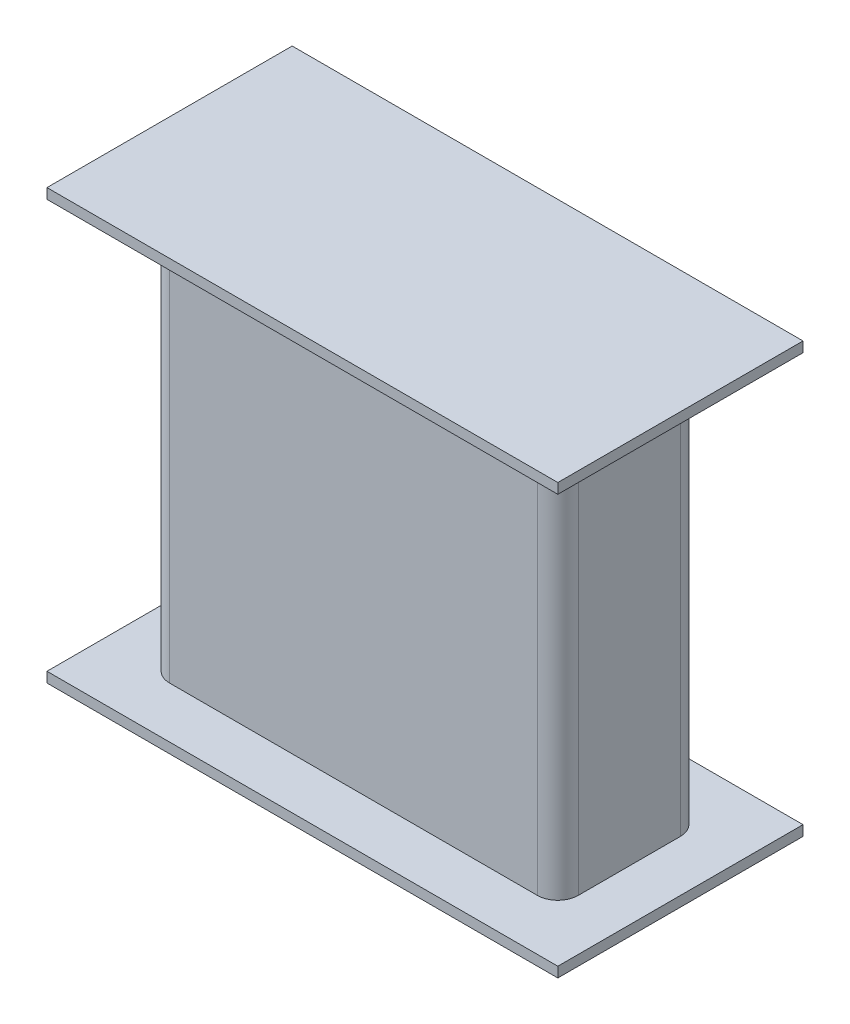
ISO-10303-21;
HEADER;
FILE_DESCRIPTION(('STEP AP214'),'2;1');
FILE_NAME('part.step','',(''),(''),'','','');
FILE_SCHEMA(('AUTOMOTIVE_DESIGN { 1 0 10303 214 1 1 1 1 }'));
ENDSEC;
DATA;
#1=APPLICATION_CONTEXT('core data for automotive mechanical design processes');
#2=APPLICATION_PROTOCOL_DEFINITION('international standard','automotive_design',2000,#1);
#3=PRODUCT_CONTEXT('',#1,'mechanical');
#4=PRODUCT('Part','Part','',(#3));
#5=PRODUCT_RELATED_PRODUCT_CATEGORY('part','',(#4));
#6=PRODUCT_DEFINITION_FORMATION('','',#4);
#7=PRODUCT_DEFINITION_CONTEXT('part definition',#1,'design');
#8=PRODUCT_DEFINITION('design','',#6,#7);
#9=PRODUCT_DEFINITION_SHAPE('','',#8);
#10=(LENGTH_UNIT() NAMED_UNIT(*) SI_UNIT(.MILLI.,.METRE.));
#11=(NAMED_UNIT(*) PLANE_ANGLE_UNIT() SI_UNIT($,.RADIAN.));
#12=(NAMED_UNIT(*) SI_UNIT($,.STERADIAN.) SOLID_ANGLE_UNIT());
#13=UNCERTAINTY_MEASURE_WITH_UNIT(LENGTH_MEASURE(1.E-05),#10,'distance_accuracy_value','');
#14=(GEOMETRIC_REPRESENTATION_CONTEXT(3) GLOBAL_UNCERTAINTY_ASSIGNED_CONTEXT((#13)) GLOBAL_UNIT_ASSIGNED_CONTEXT((#10,
#11,#12)) REPRESENTATION_CONTEXT('',''));
#15=CARTESIAN_POINT('',(0.,0.,0.));
#16=DIRECTION('',(0.,0.,1.));
#17=DIRECTION('',(1.,0.,0.));
#18=AXIS2_PLACEMENT_3D('',#15,#16,#17);
#19=CARTESIAN_POINT('',(0.,40.,-14.));
#20=DIRECTION('',(1.,0.,0.));
#21=DIRECTION('',(0.,0.,-1.));
#22=AXIS2_PLACEMENT_3D('',#19,#20,#21);
#23=PLANE('',#22);
#24=DIRECTION('',(0.,0.,1.));
#25=VECTOR('',#24,1.);
#26=CARTESIAN_POINT('',(0.,40.,-14.));
#27=LINE('',#26,#25);
#28=CARTESIAN_POINT('',(0.,40.,-12.));
#29=VERTEX_POINT('',#28);
#30=CARTESIAN_POINT('',(0.,40.,-2.00000000000001));
#31=VERTEX_POINT('',#30);
#32=EDGE_CURVE('E315',#29,#31,#27,.T.);
#33=ORIENTED_EDGE('',*,*,#32,.F.);
#34=DIRECTION('',(0.,-1.,0.));
#35=VECTOR('',#34,1.);
#36=CARTESIAN_POINT('',(0.,40.,-12.));
#37=LINE('',#36,#35);
#38=CARTESIAN_POINT('',(0.,0.,-12.));
#39=VERTEX_POINT('',#38);
#40=EDGE_CURVE('E289',#29,#39,#37,.T.);
#41=ORIENTED_EDGE('',*,*,#40,.T.);
#42=DIRECTION('',(0.,0.,1.));
#43=VECTOR('',#42,1.);
#44=CARTESIAN_POINT('',(0.,0.,-14.));
#45=LINE('',#44,#43);
#46=CARTESIAN_POINT('',(0.,0.,-2.00000000000001));
#47=VERTEX_POINT('',#46);
#48=EDGE_CURVE('E314',#39,#47,#45,.T.);
#49=ORIENTED_EDGE('',*,*,#48,.T.);
#50=DIRECTION('',(0.,-1.,0.));
#51=VECTOR('',#50,1.);
#52=CARTESIAN_POINT('',(0.,40.,-2.00000000000001));
#53=LINE('',#52,#51);
#54=EDGE_CURVE('E292',#31,#47,#53,.T.);
#55=ORIENTED_EDGE('',*,*,#54,.F.);
#56=EDGE_LOOP('',(#33,#41,#49,#55));
#57=FACE_BOUND('',#56,.T.);
#58=ADVANCED_FACE('F33',(#57),#23,.F.);
#59=CARTESIAN_POINT('',(0.,40.,0.));
#60=DIRECTION('',(0.,0.,-1.));
#61=DIRECTION('',(-1.,0.,0.));
#62=AXIS2_PLACEMENT_3D('',#59,#60,#61);
#63=PLANE('',#62);
#64=DIRECTION('',(1.,0.,0.));
#65=VECTOR('',#64,1.);
#66=CARTESIAN_POINT('',(0.,40.,0.));
#67=LINE('',#66,#65);
#68=CARTESIAN_POINT('',(2.,40.,0.));
#69=VERTEX_POINT('',#68);
#70=CARTESIAN_POINT('',(38.,40.,0.));
#71=VERTEX_POINT('',#70);
#72=EDGE_CURVE('E317',#69,#71,#67,.T.);
#73=ORIENTED_EDGE('',*,*,#72,.F.);
#74=DIRECTION('',(0.,-1.,0.));
#75=VECTOR('',#74,1.);
#76=CARTESIAN_POINT('',(2.00000000000001,40.,0.));
#77=LINE('',#76,#75);
#78=CARTESIAN_POINT('',(2.,0.,0.));
#79=VERTEX_POINT('',#78);
#80=EDGE_CURVE('E294',#69,#79,#77,.T.);
#81=ORIENTED_EDGE('',*,*,#80,.T.);
#82=DIRECTION('',(1.,0.,0.));
#83=VECTOR('',#82,1.);
#84=CARTESIAN_POINT('',(0.,0.,0.));
#85=LINE('',#84,#83);
#86=CARTESIAN_POINT('',(38.,0.,0.));
#87=VERTEX_POINT('',#86);
#88=EDGE_CURVE('E322',#79,#87,#85,.T.);
#89=ORIENTED_EDGE('',*,*,#88,.T.);
#90=DIRECTION('',(0.,-1.,0.));
#91=VECTOR('',#90,1.);
#92=CARTESIAN_POINT('',(38.,40.,0.));
#93=LINE('',#92,#91);
#94=EDGE_CURVE('E296',#71,#87,#93,.T.);
#95=ORIENTED_EDGE('',*,*,#94,.F.);
#96=EDGE_LOOP('',(#73,#81,#89,#95));
#97=FACE_BOUND('',#96,.T.);
#98=ADVANCED_FACE('F349',(#97),#63,.F.);
#99=CARTESIAN_POINT('',(40.,40.,-14.));
#100=DIRECTION('',(1.,0.,0.));
#101=DIRECTION('',(0.,0.,-1.));
#102=AXIS2_PLACEMENT_3D('',#99,#100,#101);
#103=PLANE('',#102);
#104=DIRECTION('',(0.,-1.,0.));
#105=VECTOR('',#104,1.);
#106=CARTESIAN_POINT('',(40.,40.,-12.));
#107=LINE('',#106,#105);
#108=CARTESIAN_POINT('',(40.,40.,-12.));
#109=VERTEX_POINT('',#108);
#110=CARTESIAN_POINT('',(40.,0.,-12.));
#111=VERTEX_POINT('',#110);
#112=EDGE_CURVE('E274',#109,#111,#107,.T.);
#113=ORIENTED_EDGE('',*,*,#112,.F.);
#114=DIRECTION('',(0.,0.,1.));
#115=VECTOR('',#114,1.);
#116=CARTESIAN_POINT('',(40.,40.,-14.));
#117=LINE('',#116,#115);
#118=CARTESIAN_POINT('',(40.,40.,-2.00000000000001));
#119=VERTEX_POINT('',#118);
#120=EDGE_CURVE('E41',#109,#119,#117,.T.);
#121=ORIENTED_EDGE('',*,*,#120,.T.);
#122=DIRECTION('',(0.,-1.,0.));
#123=VECTOR('',#122,1.);
#124=CARTESIAN_POINT('',(40.,40.,-2.00000000000001));
#125=LINE('',#124,#123);
#126=CARTESIAN_POINT('',(40.,0.,-2.));
#127=VERTEX_POINT('',#126);
#128=EDGE_CURVE('E298',#119,#127,#125,.T.);
#129=ORIENTED_EDGE('',*,*,#128,.T.);
#130=DIRECTION('',(0.,0.,1.));
#131=VECTOR('',#130,1.);
#132=CARTESIAN_POINT('',(40.,0.,-14.));
#133=LINE('',#132,#131);
#134=EDGE_CURVE('E324',#111,#127,#133,.T.);
#135=ORIENTED_EDGE('',*,*,#134,.F.);
#136=EDGE_LOOP('',(#113,#121,#129,#135));
#137=FACE_BOUND('',#136,.T.);
#138=ADVANCED_FACE('F341',(#137),#103,.T.);
#139=CARTESIAN_POINT('',(0.,40.,-14.));
#140=DIRECTION('',(0.,0.,-1.));
#141=DIRECTION('',(-1.,0.,0.));
#142=AXIS2_PLACEMENT_3D('',#139,#140,#141);
#143=PLANE('',#142);
#144=DIRECTION('',(1.,0.,0.));
#145=VECTOR('',#144,1.);
#146=CARTESIAN_POINT('',(0.,40.,-14.));
#147=LINE('',#146,#145);
#148=CARTESIAN_POINT('',(2.,40.,-14.));
#149=VERTEX_POINT('',#148);
#150=CARTESIAN_POINT('',(38.,40.,-14.));
#151=VERTEX_POINT('',#150);
#152=EDGE_CURVE('E12',#149,#151,#147,.T.);
#153=ORIENTED_EDGE('',*,*,#152,.T.);
#154=DIRECTION('',(0.,-1.,0.));
#155=VECTOR('',#154,1.);
#156=CARTESIAN_POINT('',(38.,40.,-14.));
#157=LINE('',#156,#155);
#158=CARTESIAN_POINT('',(38.,0.,-14.));
#159=VERTEX_POINT('',#158);
#160=EDGE_CURVE('E283',#151,#159,#157,.T.);
#161=ORIENTED_EDGE('',*,*,#160,.T.);
#162=DIRECTION('',(1.,0.,0.));
#163=VECTOR('',#162,1.);
#164=CARTESIAN_POINT('',(0.,0.,-14.));
#165=LINE('',#164,#163);
#166=CARTESIAN_POINT('',(2.00000000000001,0.,-14.));
#167=VERTEX_POINT('',#166);
#168=EDGE_CURVE('E36',#167,#159,#165,.T.);
#169=ORIENTED_EDGE('',*,*,#168,.F.);
#170=DIRECTION('',(0.,-1.,0.));
#171=VECTOR('',#170,1.);
#172=CARTESIAN_POINT('',(2.00000000000001,40.,-14.));
#173=LINE('',#172,#171);
#174=EDGE_CURVE('E287',#149,#167,#173,.T.);
#175=ORIENTED_EDGE('',*,*,#174,.F.);
#176=EDGE_LOOP('',(#153,#161,#169,#175));
#177=FACE_BOUND('',#176,.T.);
#178=ADVANCED_FACE('F335',(#177),#143,.T.);
#179=CARTESIAN_POINT('',(2.,40.,-12.));
#180=DIRECTION('',(0.,-1.,0.));
#181=DIRECTION('',(0.,0.,-1.));
#182=AXIS2_PLACEMENT_3D('',#179,#180,#181);
#183=CYLINDRICAL_SURFACE('',#182,2.);
#184=CARTESIAN_POINT('',(2.,0.,-12.));
#185=DIRECTION('',(0.,-1.,0.));
#186=DIRECTION('',(0.,0.,1.));
#187=AXIS2_PLACEMENT_3D('',#184,#185,#186);
#188=CIRCLE('',#187,2.);
#189=EDGE_CURVE('E265',#39,#167,#188,.T.);
#190=ORIENTED_EDGE('',*,*,#189,.F.);
#191=ORIENTED_EDGE('',*,*,#40,.F.);
#192=CARTESIAN_POINT('',(2.,40.,-12.));
#193=DIRECTION('',(0.,-1.,0.));
#194=DIRECTION('',(0.,0.,1.));
#195=AXIS2_PLACEMENT_3D('',#192,#193,#194);
#196=CIRCLE('',#195,2.);
#197=EDGE_CURVE('E271',#29,#149,#196,.T.);
#198=ORIENTED_EDGE('',*,*,#197,.T.);
#199=ORIENTED_EDGE('',*,*,#174,.T.);
#200=EDGE_LOOP('',(#190,#191,#198,#199));
#201=FACE_BOUND('',#200,.T.);
#202=ADVANCED_FACE('F357',(#201),#183,.T.);
#203=CARTESIAN_POINT('',(38.,40.,-12.));
#204=DIRECTION('',(0.,-1.,0.));
#205=DIRECTION('',(0.,0.,-1.));
#206=AXIS2_PLACEMENT_3D('',#203,#204,#205);
#207=CYLINDRICAL_SURFACE('',#206,2.);
#208=CARTESIAN_POINT('',(38.,0.,-12.));
#209=DIRECTION('',(0.,-1.,0.));
#210=DIRECTION('',(0.,0.,-1.));
#211=AXIS2_PLACEMENT_3D('',#208,#209,#210);
#212=CIRCLE('',#211,2.);
#213=EDGE_CURVE('E260',#159,#111,#212,.T.);
#214=ORIENTED_EDGE('',*,*,#213,.F.);
#215=ORIENTED_EDGE('',*,*,#160,.F.);
#216=CARTESIAN_POINT('',(38.,40.,-12.));
#217=DIRECTION('',(0.,-1.,0.));
#218=DIRECTION('',(0.,0.,-1.));
#219=AXIS2_PLACEMENT_3D('',#216,#217,#218);
#220=CIRCLE('',#219,2.);
#221=EDGE_CURVE('E261',#151,#109,#220,.T.);
#222=ORIENTED_EDGE('',*,*,#221,.T.);
#223=ORIENTED_EDGE('',*,*,#112,.T.);
#224=EDGE_LOOP('',(#214,#215,#222,#223));
#225=FACE_BOUND('',#224,.T.);
#226=ADVANCED_FACE('F338',(#225),#207,.T.);
#227=CARTESIAN_POINT('',(38.,40.,-2.));
#228=DIRECTION('',(0.,-1.,0.));
#229=DIRECTION('',(0.,0.,-1.));
#230=AXIS2_PLACEMENT_3D('',#227,#228,#229);
#231=CYLINDRICAL_SURFACE('',#230,2.);
#232=CARTESIAN_POINT('',(38.,0.,-2.));
#233=DIRECTION('',(0.,-1.,0.));
#234=DIRECTION('',(0.,0.,1.));
#235=AXIS2_PLACEMENT_3D('',#232,#233,#234);
#236=CIRCLE('',#235,2.);
#237=EDGE_CURVE('E277',#127,#87,#236,.T.);
#238=ORIENTED_EDGE('',*,*,#237,.F.);
#239=ORIENTED_EDGE('',*,*,#128,.F.);
#240=CARTESIAN_POINT('',(38.,40.,-2.));
#241=DIRECTION('',(0.,-1.,0.));
#242=DIRECTION('',(0.,0.,1.));
#243=AXIS2_PLACEMENT_3D('',#240,#241,#242);
#244=CIRCLE('',#243,2.);
#245=EDGE_CURVE('E264',#119,#71,#244,.T.);
#246=ORIENTED_EDGE('',*,*,#245,.T.);
#247=ORIENTED_EDGE('',*,*,#94,.T.);
#248=EDGE_LOOP('',(#238,#239,#246,#247));
#249=FACE_BOUND('',#248,.T.);
#250=ADVANCED_FACE('F344',(#249),#231,.T.);
#251=CARTESIAN_POINT('',(2.,40.,-2.));
#252=DIRECTION('',(0.,-1.,0.));
#253=DIRECTION('',(0.,0.,-1.));
#254=AXIS2_PLACEMENT_3D('',#251,#252,#253);
#255=CYLINDRICAL_SURFACE('',#254,2.);
#256=CARTESIAN_POINT('',(2.,0.,-2.));
#257=DIRECTION('',(0.,-1.,0.));
#258=DIRECTION('',(0.,0.,1.));
#259=AXIS2_PLACEMENT_3D('',#256,#257,#258);
#260=CIRCLE('',#259,2.);
#261=EDGE_CURVE('E57',#79,#47,#260,.T.);
#262=ORIENTED_EDGE('',*,*,#261,.F.);
#263=ORIENTED_EDGE('',*,*,#80,.F.);
#264=CARTESIAN_POINT('',(2.,40.,-2.));
#265=DIRECTION('',(0.,-1.,0.));
#266=DIRECTION('',(0.,0.,1.));
#267=AXIS2_PLACEMENT_3D('',#264,#265,#266);
#268=CIRCLE('',#267,2.);
#269=EDGE_CURVE('E268',#69,#31,#268,.T.);
#270=ORIENTED_EDGE('',*,*,#269,.T.);
#271=ORIENTED_EDGE('',*,*,#54,.T.);
#272=EDGE_LOOP('',(#262,#263,#270,#271));
#273=FACE_BOUND('',#272,.T.);
#274=ADVANCED_FACE('F350',(#273),#255,.T.);
#275=CARTESIAN_POINT('',(0.,40.,0.));
#276=DIRECTION('',(0.,1.,0.));
#277=DIRECTION('',(0.,0.,1.));
#278=AXIS2_PLACEMENT_3D('',#275,#276,#277);
#279=PLANE('',#278);
#280=ORIENTED_EDGE('',*,*,#221,.F.);
#281=ORIENTED_EDGE('',*,*,#152,.F.);
#282=ORIENTED_EDGE('',*,*,#197,.F.);
#283=ORIENTED_EDGE('',*,*,#32,.T.);
#284=ORIENTED_EDGE('',*,*,#269,.F.);
#285=ORIENTED_EDGE('',*,*,#72,.T.);
#286=ORIENTED_EDGE('',*,*,#245,.F.);
#287=ORIENTED_EDGE('',*,*,#120,.F.);
#288=EDGE_LOOP('',(#280,#281,#282,#283,#284,#285,#286,#287));
#289=FACE_BOUND('',#288,.T.);
#290=DIRECTION('',(0.,0.,1.));
#291=VECTOR('',#290,1.);
#292=CARTESIAN_POINT('',(-5.,40.,-19.));
#293=LINE('',#292,#291);
#294=CARTESIAN_POINT('',(-5.,40.,-19.));
#295=VERTEX_POINT('',#294);
#296=CARTESIAN_POINT('',(-5.,40.,5.));
#297=VERTEX_POINT('',#296);
#298=EDGE_CURVE('E230',#295,#297,#293,.T.);
#299=ORIENTED_EDGE('',*,*,#298,.F.);
#300=DIRECTION('',(-1.,0.,0.));
#301=VECTOR('',#300,1.);
#302=CARTESIAN_POINT('',(-5.,40.,-19.));
#303=LINE('',#302,#301);
#304=CARTESIAN_POINT('',(45.,40.,-19.));
#305=VERTEX_POINT('',#304);
#306=EDGE_CURVE('E235',#305,#295,#303,.T.);
#307=ORIENTED_EDGE('',*,*,#306,.F.);
#308=DIRECTION('',(0.,0.,-1.));
#309=VECTOR('',#308,1.);
#310=CARTESIAN_POINT('',(45.,40.,-19.));
#311=LINE('',#310,#309);
#312=CARTESIAN_POINT('',(45.,40.,5.));
#313=VERTEX_POINT('',#312);
#314=EDGE_CURVE('E246',#313,#305,#311,.T.);
#315=ORIENTED_EDGE('',*,*,#314,.F.);
#316=DIRECTION('',(1.,0.,0.));
#317=VECTOR('',#316,1.);
#318=CARTESIAN_POINT('',(-5.,40.,5.));
#319=LINE('',#318,#317);
#320=EDGE_CURVE('E244',#297,#313,#319,.T.);
#321=ORIENTED_EDGE('',*,*,#320,.F.);
#322=EDGE_LOOP('',(#299,#307,#315,#321));
#323=FACE_BOUND('',#322,.T.);
#324=ADVANCED_FACE('F358',(#289,#323),#279,.F.);
#325=CARTESIAN_POINT('',(0.,41.,0.));
#326=DIRECTION('',(0.,1.,0.));
#327=DIRECTION('',(0.,0.,1.));
#328=AXIS2_PLACEMENT_3D('',#325,#326,#327);
#329=PLANE('',#328);
#330=DIRECTION('',(0.,0.,1.));
#331=VECTOR('',#330,1.);
#332=CARTESIAN_POINT('',(-5.,41.,-19.));
#333=LINE('',#332,#331);
#334=CARTESIAN_POINT('',(-5.,41.,-19.));
#335=VERTEX_POINT('',#334);
#336=CARTESIAN_POINT('',(-5.,41.,5.));
#337=VERTEX_POINT('',#336);
#338=EDGE_CURVE('E231',#335,#337,#333,.T.);
#339=ORIENTED_EDGE('',*,*,#338,.T.);
#340=DIRECTION('',(1.,0.,0.));
#341=VECTOR('',#340,1.);
#342=CARTESIAN_POINT('',(-5.,41.,5.));
#343=LINE('',#342,#341);
#344=CARTESIAN_POINT('',(45.,41.,5.));
#345=VERTEX_POINT('',#344);
#346=EDGE_CURVE('E234',#337,#345,#343,.T.);
#347=ORIENTED_EDGE('',*,*,#346,.T.);
#348=DIRECTION('',(0.,0.,-1.));
#349=VECTOR('',#348,1.);
#350=CARTESIAN_POINT('',(45.,41.,-19.));
#351=LINE('',#350,#349);
#352=CARTESIAN_POINT('',(45.,41.,-19.));
#353=VERTEX_POINT('',#352);
#354=EDGE_CURVE('E237',#345,#353,#351,.T.);
#355=ORIENTED_EDGE('',*,*,#354,.T.);
#356=DIRECTION('',(-1.,0.,0.));
#357=VECTOR('',#356,1.);
#358=CARTESIAN_POINT('',(-5.,41.,-19.));
#359=LINE('',#358,#357);
#360=EDGE_CURVE('E239',#353,#335,#359,.T.);
#361=ORIENTED_EDGE('',*,*,#360,.T.);
#362=EDGE_LOOP('',(#339,#347,#355,#361));
#363=FACE_BOUND('',#362,.T.);
#364=ADVANCED_FACE('F361',(#363),#329,.T.);
#365=CARTESIAN_POINT('',(-5.,41.,-19.));
#366=DIRECTION('',(0.,0.,1.));
#367=DIRECTION('',(1.,0.,0.));
#368=AXIS2_PLACEMENT_3D('',#365,#366,#367);
#369=PLANE('',#368);
#370=ORIENTED_EDGE('',*,*,#306,.T.);
#371=DIRECTION('',(0.,-1.,0.));
#372=VECTOR('',#371,1.);
#373=CARTESIAN_POINT('',(-5.,41.,-19.));
#374=LINE('',#373,#372);
#375=EDGE_CURVE('E241',#335,#295,#374,.T.);
#376=ORIENTED_EDGE('',*,*,#375,.F.);
#377=ORIENTED_EDGE('',*,*,#360,.F.);
#378=DIRECTION('',(0.,-1.,0.));
#379=VECTOR('',#378,1.);
#380=CARTESIAN_POINT('',(45.,41.,-19.));
#381=LINE('',#380,#379);
#382=EDGE_CURVE('E251',#353,#305,#381,.T.);
#383=ORIENTED_EDGE('',*,*,#382,.T.);
#384=EDGE_LOOP('',(#370,#376,#377,#383));
#385=FACE_BOUND('',#384,.T.);
#386=ADVANCED_FACE('F374',(#385),#369,.F.);
#387=CARTESIAN_POINT('',(45.,41.,-19.));
#388=DIRECTION('',(-1.,0.,0.));
#389=DIRECTION('',(0.,0.,1.));
#390=AXIS2_PLACEMENT_3D('',#387,#388,#389);
#391=PLANE('',#390);
#392=ORIENTED_EDGE('',*,*,#314,.T.);
#393=ORIENTED_EDGE('',*,*,#382,.F.);
#394=ORIENTED_EDGE('',*,*,#354,.F.);
#395=DIRECTION('',(0.,-1.,0.));
#396=VECTOR('',#395,1.);
#397=CARTESIAN_POINT('',(45.,41.,5.));
#398=LINE('',#397,#396);
#399=EDGE_CURVE('E254',#345,#313,#398,.T.);
#400=ORIENTED_EDGE('',*,*,#399,.T.);
#401=EDGE_LOOP('',(#392,#393,#394,#400));
#402=FACE_BOUND('',#401,.T.);
#403=ADVANCED_FACE('F378',(#402),#391,.F.);
#404=CARTESIAN_POINT('',(-5.,41.,5.));
#405=DIRECTION('',(0.,0.,-1.));
#406=DIRECTION('',(-1.,0.,0.));
#407=AXIS2_PLACEMENT_3D('',#404,#405,#406);
#408=PLANE('',#407);
#409=ORIENTED_EDGE('',*,*,#320,.T.);
#410=ORIENTED_EDGE('',*,*,#399,.F.);
#411=ORIENTED_EDGE('',*,*,#346,.F.);
#412=DIRECTION('',(0.,-1.,0.));
#413=VECTOR('',#412,1.);
#414=CARTESIAN_POINT('',(-5.,41.,5.));
#415=LINE('',#414,#413);
#416=EDGE_CURVE('E257',#337,#297,#415,.T.);
#417=ORIENTED_EDGE('',*,*,#416,.T.);
#418=EDGE_LOOP('',(#409,#410,#411,#417));
#419=FACE_BOUND('',#418,.T.);
#420=ADVANCED_FACE('F381',(#419),#408,.F.);
#421=CARTESIAN_POINT('',(-5.,41.,-19.));
#422=DIRECTION('',(1.,0.,0.));
#423=DIRECTION('',(0.,0.,-1.));
#424=AXIS2_PLACEMENT_3D('',#421,#422,#423);
#425=PLANE('',#424);
#426=ORIENTED_EDGE('',*,*,#298,.T.);
#427=ORIENTED_EDGE('',*,*,#416,.F.);
#428=ORIENTED_EDGE('',*,*,#338,.F.);
#429=ORIENTED_EDGE('',*,*,#375,.T.);
#430=EDGE_LOOP('',(#426,#427,#428,#429));
#431=FACE_BOUND('',#430,.T.);
#432=ADVANCED_FACE('F369',(#431),#425,.F.);
#433=CARTESIAN_POINT('',(0.,0.,0.));
#434=DIRECTION('',(0.,1.,0.));
#435=DIRECTION('',(0.,0.,1.));
#436=AXIS2_PLACEMENT_3D('',#433,#434,#435);
#437=PLANE('',#436);
#438=ORIENTED_EDGE('',*,*,#168,.T.);
#439=ORIENTED_EDGE('',*,*,#213,.T.);
#440=ORIENTED_EDGE('',*,*,#134,.T.);
#441=ORIENTED_EDGE('',*,*,#237,.T.);
#442=ORIENTED_EDGE('',*,*,#88,.F.);
#443=ORIENTED_EDGE('',*,*,#261,.T.);
#444=ORIENTED_EDGE('',*,*,#48,.F.);
#445=ORIENTED_EDGE('',*,*,#189,.T.);
#446=EDGE_LOOP('',(#438,#439,#440,#441,#442,#443,#444,#445));
#447=FACE_BOUND('',#446,.T.);
#448=DIRECTION('',(0.,0.,-1.));
#449=VECTOR('',#448,1.);
#450=CARTESIAN_POINT('',(-5.,0.,-19.));
#451=LINE('',#450,#449);
#452=CARTESIAN_POINT('',(-5.,0.,5.));
#453=VERTEX_POINT('',#452);
#454=CARTESIAN_POINT('',(-5.,0.,-19.));
#455=VERTEX_POINT('',#454);
#456=EDGE_CURVE('E197',#453,#455,#451,.T.);
#457=ORIENTED_EDGE('',*,*,#456,.F.);
#458=DIRECTION('',(-1.,0.,0.));
#459=VECTOR('',#458,1.);
#460=CARTESIAN_POINT('',(-5.,0.,5.));
#461=LINE('',#460,#459);
#462=CARTESIAN_POINT('',(45.,0.,5.));
#463=VERTEX_POINT('',#462);
#464=EDGE_CURVE('E205',#463,#453,#461,.T.);
#465=ORIENTED_EDGE('',*,*,#464,.F.);
#466=DIRECTION('',(0.,0.,1.));
#467=VECTOR('',#466,1.);
#468=CARTESIAN_POINT('',(45.,0.,-19.));
#469=LINE('',#468,#467);
#470=CARTESIAN_POINT('',(45.,0.,-19.));
#471=VERTEX_POINT('',#470);
#472=EDGE_CURVE('E216',#471,#463,#469,.T.);
#473=ORIENTED_EDGE('',*,*,#472,.F.);
#474=DIRECTION('',(1.,0.,0.));
#475=VECTOR('',#474,1.);
#476=CARTESIAN_POINT('',(-5.,0.,-19.));
#477=LINE('',#476,#475);
#478=EDGE_CURVE('E214',#455,#471,#477,.T.);
#479=ORIENTED_EDGE('',*,*,#478,.F.);
#480=EDGE_LOOP('',(#457,#465,#473,#479));
#481=FACE_BOUND('',#480,.T.);
#482=ADVANCED_FACE('F330',(#447,#481),#437,.T.);
#483=CARTESIAN_POINT('',(0.,-1.,0.));
#484=DIRECTION('',(0.,1.,0.));
#485=DIRECTION('',(0.,0.,1.));
#486=AXIS2_PLACEMENT_3D('',#483,#484,#485);
#487=PLANE('',#486);
#488=DIRECTION('',(1.,0.,0.));
#489=VECTOR('',#488,1.);
#490=CARTESIAN_POINT('',(2.,-1.,-12.));
#491=LINE('',#490,#489);
#492=CARTESIAN_POINT('',(2.,-1.,-12.));
#493=VERTEX_POINT('',#492);
#494=CARTESIAN_POINT('',(38.,-1.,-12.));
#495=VERTEX_POINT('',#494);
#496=EDGE_CURVE('E186',#493,#495,#491,.T.);
#497=ORIENTED_EDGE('',*,*,#496,.F.);
#498=DIRECTION('',(0.,0.,-1.));
#499=VECTOR('',#498,1.);
#500=CARTESIAN_POINT('',(2.,-1.,-12.));
#501=LINE('',#500,#499);
#502=CARTESIAN_POINT('',(2.,-1.,-2.));
#503=VERTEX_POINT('',#502);
#504=EDGE_CURVE('E190',#503,#493,#501,.T.);
#505=ORIENTED_EDGE('',*,*,#504,.F.);
#506=DIRECTION('',(-1.,0.,0.));
#507=VECTOR('',#506,1.);
#508=CARTESIAN_POINT('',(2.,-1.,-2.));
#509=LINE('',#508,#507);
#510=CARTESIAN_POINT('',(38.,-1.,-2.));
#511=VERTEX_POINT('',#510);
#512=EDGE_CURVE('E195',#511,#503,#509,.T.);
#513=ORIENTED_EDGE('',*,*,#512,.F.);
#514=DIRECTION('',(0.,0.,1.));
#515=VECTOR('',#514,1.);
#516=CARTESIAN_POINT('',(38.,-1.,-12.));
#517=LINE('',#516,#515);
#518=EDGE_CURVE('E180',#495,#511,#517,.T.);
#519=ORIENTED_EDGE('',*,*,#518,.F.);
#520=EDGE_LOOP('',(#497,#505,#513,#519));
#521=FACE_BOUND('',#520,.T.);
#522=DIRECTION('',(0.,0.,-1.));
#523=VECTOR('',#522,1.);
#524=CARTESIAN_POINT('',(-5.,-1.,-19.));
#525=LINE('',#524,#523);
#526=CARTESIAN_POINT('',(-5.,-1.,5.));
#527=VERTEX_POINT('',#526);
#528=CARTESIAN_POINT('',(-5.,-1.,-19.));
#529=VERTEX_POINT('',#528);
#530=EDGE_CURVE('E201',#527,#529,#525,.T.);
#531=ORIENTED_EDGE('',*,*,#530,.T.);
#532=DIRECTION('',(1.,0.,0.));
#533=VECTOR('',#532,1.);
#534=CARTESIAN_POINT('',(-5.,-1.,-19.));
#535=LINE('',#534,#533);
#536=CARTESIAN_POINT('',(45.,-1.,-19.));
#537=VERTEX_POINT('',#536);
#538=EDGE_CURVE('E204',#529,#537,#535,.T.);
#539=ORIENTED_EDGE('',*,*,#538,.T.);
#540=DIRECTION('',(0.,0.,1.));
#541=VECTOR('',#540,1.);
#542=CARTESIAN_POINT('',(45.,-1.,-19.));
#543=LINE('',#542,#541);
#544=CARTESIAN_POINT('',(45.,-1.,5.));
#545=VERTEX_POINT('',#544);
#546=EDGE_CURVE('E207',#537,#545,#543,.T.);
#547=ORIENTED_EDGE('',*,*,#546,.T.);
#548=DIRECTION('',(-1.,0.,0.));
#549=VECTOR('',#548,1.);
#550=CARTESIAN_POINT('',(-5.,-1.,5.));
#551=LINE('',#550,#549);
#552=EDGE_CURVE('E209',#545,#527,#551,.T.);
#553=ORIENTED_EDGE('',*,*,#552,.T.);
#554=EDGE_LOOP('',(#531,#539,#547,#553));
#555=FACE_BOUND('',#554,.T.);
#556=ADVANCED_FACE('F192',(#521,#555),#487,.F.);
#557=CARTESIAN_POINT('',(-5.,-1.,5.));
#558=DIRECTION('',(0.,0.,-1.));
#559=DIRECTION('',(-1.,0.,0.));
#560=AXIS2_PLACEMENT_3D('',#557,#558,#559);
#561=PLANE('',#560);
#562=ORIENTED_EDGE('',*,*,#464,.T.);
#563=DIRECTION('',(0.,1.,0.));
#564=VECTOR('',#563,1.);
#565=CARTESIAN_POINT('',(-5.,-1.,5.));
#566=LINE('',#565,#564);
#567=EDGE_CURVE('E211',#527,#453,#566,.T.);
#568=ORIENTED_EDGE('',*,*,#567,.F.);
#569=ORIENTED_EDGE('',*,*,#552,.F.);
#570=DIRECTION('',(0.,1.,0.));
#571=VECTOR('',#570,1.);
#572=CARTESIAN_POINT('',(45.,-1.,5.));
#573=LINE('',#572,#571);
#574=EDGE_CURVE('E221',#545,#463,#573,.T.);
#575=ORIENTED_EDGE('',*,*,#574,.T.);
#576=EDGE_LOOP('',(#562,#568,#569,#575));
#577=FACE_BOUND('',#576,.T.);
#578=ADVANCED_FACE('F453',(#577),#561,.F.);
#579=CARTESIAN_POINT('',(45.,-1.,-19.));
#580=DIRECTION('',(-1.,0.,0.));
#581=DIRECTION('',(0.,0.,1.));
#582=AXIS2_PLACEMENT_3D('',#579,#580,#581);
#583=PLANE('',#582);
#584=ORIENTED_EDGE('',*,*,#472,.T.);
#585=ORIENTED_EDGE('',*,*,#574,.F.);
#586=ORIENTED_EDGE('',*,*,#546,.F.);
#587=DIRECTION('',(0.,1.,0.));
#588=VECTOR('',#587,1.);
#589=CARTESIAN_POINT('',(45.,-1.,-19.));
#590=LINE('',#589,#588);
#591=EDGE_CURVE('E224',#537,#471,#590,.T.);
#592=ORIENTED_EDGE('',*,*,#591,.T.);
#593=EDGE_LOOP('',(#584,#585,#586,#592));
#594=FACE_BOUND('',#593,.T.);
#595=ADVANCED_FACE('F461',(#594),#583,.F.);
#596=CARTESIAN_POINT('',(-5.,-1.,-19.));
#597=DIRECTION('',(0.,0.,1.));
#598=DIRECTION('',(1.,0.,0.));
#599=AXIS2_PLACEMENT_3D('',#596,#597,#598);
#600=PLANE('',#599);
#601=ORIENTED_EDGE('',*,*,#478,.T.);
#602=ORIENTED_EDGE('',*,*,#591,.F.);
#603=ORIENTED_EDGE('',*,*,#538,.F.);
#604=DIRECTION('',(0.,1.,0.));
#605=VECTOR('',#604,1.);
#606=CARTESIAN_POINT('',(-5.,-1.,-19.));
#607=LINE('',#606,#605);
#608=EDGE_CURVE('E227',#529,#455,#607,.T.);
#609=ORIENTED_EDGE('',*,*,#608,.T.);
#610=EDGE_LOOP('',(#601,#602,#603,#609));
#611=FACE_BOUND('',#610,.T.);
#612=ADVANCED_FACE('F469',(#611),#600,.F.);
#613=CARTESIAN_POINT('',(-5.,-1.,-19.));
#614=DIRECTION('',(1.,0.,0.));
#615=DIRECTION('',(0.,0.,-1.));
#616=AXIS2_PLACEMENT_3D('',#613,#614,#615);
#617=PLANE('',#616);
#618=ORIENTED_EDGE('',*,*,#456,.T.);
#619=ORIENTED_EDGE('',*,*,#608,.F.);
#620=ORIENTED_EDGE('',*,*,#530,.F.);
#621=ORIENTED_EDGE('',*,*,#567,.T.);
#622=EDGE_LOOP('',(#618,#619,#620,#621));
#623=FACE_BOUND('',#622,.T.);
#624=ADVANCED_FACE('F477',(#623),#617,.F.);
#625=DIRECTION('',(0.,0.,-1.));
#626=VECTOR('',#625,1.);
#627=CARTESIAN_POINT('',(2.,40.,-2.));
#628=LINE('',#627,#626);
#629=CARTESIAN_POINT('',(2.,40.,-2.));
#630=VERTEX_POINT('',#629);
#631=CARTESIAN_POINT('',(2.,40.,-12.));
#632=VERTEX_POINT('',#631);
#633=EDGE_CURVE('E286',#630,#632,#628,.T.);
#634=ORIENTED_EDGE('',*,*,#633,.T.);
#635=DIRECTION('',(1.,0.,0.));
#636=VECTOR('',#635,1.);
#637=CARTESIAN_POINT('',(2.,40.,-12.));
#638=LINE('',#637,#636);
#639=CARTESIAN_POINT('',(38.,40.,-12.));
#640=VERTEX_POINT('',#639);
#641=EDGE_CURVE('E303',#632,#640,#638,.T.);
#642=ORIENTED_EDGE('',*,*,#641,.T.);
#643=DIRECTION('',(0.,0.,-1.));
#644=VECTOR('',#643,1.);
#645=CARTESIAN_POINT('',(38.,40.,-2.));
#646=LINE('',#645,#644);
#647=CARTESIAN_POINT('',(38.,40.,-2.));
#648=VERTEX_POINT('',#647);
#649=EDGE_CURVE('E182',#648,#640,#646,.T.);
#650=ORIENTED_EDGE('',*,*,#649,.F.);
#651=DIRECTION('',(1.,0.,0.));
#652=VECTOR('',#651,1.);
#653=CARTESIAN_POINT('',(2.,40.,-2.));
#654=LINE('',#653,#652);
#655=EDGE_CURVE('E306',#630,#648,#654,.T.);
#656=ORIENTED_EDGE('',*,*,#655,.F.);
#657=EDGE_LOOP('',(#634,#642,#650,#656));
#658=FACE_BOUND('',#657,.T.);
#659=ADVANCED_FACE('F363',(#658),#279,.F.);
#660=CARTESIAN_POINT('',(2.,0.,-2.));
#661=DIRECTION('',(0.,0.,1.));
#662=DIRECTION('',(1.,0.,0.));
#663=AXIS2_PLACEMENT_3D('',#660,#661,#662);
#664=PLANE('',#663);
#665=ORIENTED_EDGE('',*,*,#655,.T.);
#666=DIRECTION('',(0.,1.,0.));
#667=VECTOR('',#666,1.);
#668=CARTESIAN_POINT('',(38.,0.,-2.));
#669=LINE('',#668,#667);
#670=EDGE_CURVE('E183',#511,#648,#669,.T.);
#671=ORIENTED_EDGE('',*,*,#670,.F.);
#672=ORIENTED_EDGE('',*,*,#512,.T.);
#673=DIRECTION('',(0.,1.,0.));
#674=VECTOR('',#673,1.);
#675=CARTESIAN_POINT('',(2.,0.,-2.));
#676=LINE('',#675,#674);
#677=EDGE_CURVE('E309',#503,#630,#676,.T.);
#678=ORIENTED_EDGE('',*,*,#677,.T.);
#679=EDGE_LOOP('',(#665,#671,#672,#678));
#680=FACE_BOUND('',#679,.T.);
#681=ADVANCED_FACE('F409',(#680),#664,.F.);
#682=CARTESIAN_POINT('',(38.,0.,-2.));
#683=DIRECTION('',(1.,0.,0.));
#684=DIRECTION('',(0.,0.,-1.));
#685=AXIS2_PLACEMENT_3D('',#682,#683,#684);
#686=PLANE('',#685);
#687=ORIENTED_EDGE('',*,*,#649,.T.);
#688=DIRECTION('',(0.,1.,0.));
#689=VECTOR('',#688,1.);
#690=CARTESIAN_POINT('',(38.,0.,-12.));
#691=LINE('',#690,#689);
#692=EDGE_CURVE('E176',#495,#640,#691,.T.);
#693=ORIENTED_EDGE('',*,*,#692,.F.);
#694=ORIENTED_EDGE('',*,*,#518,.T.);
#695=ORIENTED_EDGE('',*,*,#670,.T.);
#696=EDGE_LOOP('',(#687,#693,#694,#695));
#697=FACE_BOUND('',#696,.T.);
#698=ADVANCED_FACE('F177',(#697),#686,.F.);
#699=CARTESIAN_POINT('',(2.,0.,-12.));
#700=DIRECTION('',(0.,0.,1.));
#701=DIRECTION('',(1.,0.,0.));
#702=AXIS2_PLACEMENT_3D('',#699,#700,#701);
#703=PLANE('',#702);
#704=ORIENTED_EDGE('',*,*,#641,.F.);
#705=DIRECTION('',(0.,1.,0.));
#706=VECTOR('',#705,1.);
#707=CARTESIAN_POINT('',(2.,0.,-12.));
#708=LINE('',#707,#706);
#709=EDGE_CURVE('E49',#493,#632,#708,.T.);
#710=ORIENTED_EDGE('',*,*,#709,.F.);
#711=ORIENTED_EDGE('',*,*,#496,.T.);
#712=ORIENTED_EDGE('',*,*,#692,.T.);
#713=EDGE_LOOP('',(#704,#710,#711,#712));
#714=FACE_BOUND('',#713,.T.);
#715=ADVANCED_FACE('F187',(#714),#703,.T.);
#716=CARTESIAN_POINT('',(2.,0.,-2.));
#717=DIRECTION('',(1.,0.,0.));
#718=DIRECTION('',(0.,0.,-1.));
#719=AXIS2_PLACEMENT_3D('',#716,#717,#718);
#720=PLANE('',#719);
#721=ORIENTED_EDGE('',*,*,#633,.F.);
#722=ORIENTED_EDGE('',*,*,#677,.F.);
#723=ORIENTED_EDGE('',*,*,#504,.T.);
#724=ORIENTED_EDGE('',*,*,#709,.T.);
#725=EDGE_LOOP('',(#721,#722,#723,#724));
#726=FACE_BOUND('',#725,.T.);
#727=ADVANCED_FACE('F401',(#726),#720,.T.);
#728=CLOSED_SHELL('',(#58,#98,#138,#178,#202,#226,#250,#274,#324,#364,#386,#403,#420,#432,#482,
#556,#578,#595,#612,#624,#659,#681,#698,#715,#727));
#729=MANIFOLD_SOLID_BREP('B2',#728);
#730=ADVANCED_BREP_SHAPE_REPRESENTATION('',(#18,#729),#14);
#731=SHAPE_DEFINITION_REPRESENTATION(#9,#730);
ENDSEC;
END-ISO-10303-21;
